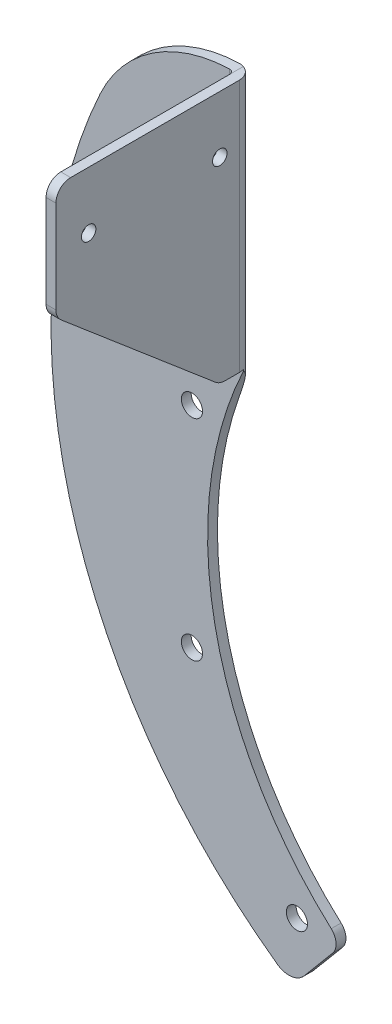
ISO-10303-21;
HEADER;
FILE_DESCRIPTION(('STEP AP214'),'2;1');
FILE_NAME('part.step','',(''),(''),'','','');
FILE_SCHEMA(('AUTOMOTIVE_DESIGN { 1 0 10303 214 1 1 1 1 }'));
ENDSEC;
DATA;
#1=APPLICATION_CONTEXT('core data for automotive mechanical design processes');
#2=APPLICATION_PROTOCOL_DEFINITION('international standard','automotive_design',2000,#1);
#3=PRODUCT_CONTEXT('',#1,'mechanical');
#4=PRODUCT('Part','Part','',(#3));
#5=PRODUCT_RELATED_PRODUCT_CATEGORY('part','',(#4));
#6=PRODUCT_DEFINITION_FORMATION('','',#4);
#7=PRODUCT_DEFINITION_CONTEXT('part definition',#1,'design');
#8=PRODUCT_DEFINITION('design','',#6,#7);
#9=PRODUCT_DEFINITION_SHAPE('','',#8);
#10=(LENGTH_UNIT() NAMED_UNIT(*) SI_UNIT(.MILLI.,.METRE.));
#11=(NAMED_UNIT(*) PLANE_ANGLE_UNIT() SI_UNIT($,.RADIAN.));
#12=(NAMED_UNIT(*) SI_UNIT($,.STERADIAN.) SOLID_ANGLE_UNIT());
#13=UNCERTAINTY_MEASURE_WITH_UNIT(LENGTH_MEASURE(1.E-05),#10,'distance_accuracy_value','');
#14=(GEOMETRIC_REPRESENTATION_CONTEXT(3) GLOBAL_UNCERTAINTY_ASSIGNED_CONTEXT((#13)) GLOBAL_UNIT_ASSIGNED_CONTEXT((#10,
#11,#12)) REPRESENTATION_CONTEXT('',''));
#15=CARTESIAN_POINT('',(0.,0.,0.));
#16=DIRECTION('',(0.,0.,1.));
#17=DIRECTION('',(1.,0.,0.));
#18=AXIS2_PLACEMENT_3D('',#15,#16,#17);
#19=CARTESIAN_POINT('',(-69.062,84.407732,2.));
#20=DIRECTION('',(0.,-1.,0.));
#21=DIRECTION('',(1.,0.,0.));
#22=AXIS2_PLACEMENT_3D('',#19,#20,#21);
#23=PLANE('',#22);
#24=DIRECTION('',(0.,0.,-1.));
#25=VECTOR('',#24,1.);
#26=CARTESIAN_POINT('',(-71.062,84.407732,40.3));
#27=LINE('',#26,#25);
#28=CARTESIAN_POINT('',(-71.062,84.407732,37.3));
#29=VERTEX_POINT('',#28);
#30=CARTESIAN_POINT('',(-71.062,84.407732,3.));
#31=VERTEX_POINT('',#30);
#32=EDGE_CURVE('E193',#29,#31,#27,.T.);
#33=ORIENTED_EDGE('',*,*,#32,.F.);
#34=DIRECTION('',(-1.,0.,0.));
#35=VECTOR('',#34,1.);
#36=CARTESIAN_POINT('',(-69.062,84.407732,37.3));
#37=LINE('',#36,#35);
#38=CARTESIAN_POINT('',(-69.062,84.407732,37.3));
#39=VERTEX_POINT('',#38);
#40=EDGE_CURVE('E283',#29,#39,#37,.F.);
#41=ORIENTED_EDGE('',*,*,#40,.T.);
#42=DIRECTION('',(0.,0.,-1.));
#43=VECTOR('',#42,1.);
#44=CARTESIAN_POINT('',(-69.062,84.407732,2.));
#45=LINE('',#44,#43);
#46=CARTESIAN_POINT('',(-69.062,84.407732,3.));
#47=VERTEX_POINT('',#46);
#48=EDGE_CURVE('E190',#39,#47,#45,.T.);
#49=ORIENTED_EDGE('',*,*,#48,.T.);
#50=CARTESIAN_POINT('',(-72.062,84.4077319999999,3.));
#51=DIRECTION('',(0.,-1.,0.));
#52=DIRECTION('',(1.,0.,0.));
#53=AXIS2_PLACEMENT_3D('',#50,#51,#52);
#54=CIRCLE('',#53,3.);
#55=CARTESIAN_POINT('',(-71.062,84.407732,0.17157287525381));
#56=VERTEX_POINT('',#55);
#57=EDGE_CURVE('E391',#47,#56,#54,.F.);
#58=ORIENTED_EDGE('',*,*,#57,.T.);
#59=DIRECTION('',(0.,0.,-1.));
#60=VECTOR('',#59,1.);
#61=CARTESIAN_POINT('',(-71.062,84.407732,2.));
#62=LINE('',#61,#60);
#63=EDGE_CURVE('E175',#31,#56,#62,.T.);
#64=ORIENTED_EDGE('',*,*,#63,.F.);
#65=EDGE_LOOP('',(#33,#41,#49,#58,#64));
#66=FACE_BOUND('',#65,.T.);
#67=ADVANCED_FACE('F35',(#66),#23,.F.);
#68=CARTESIAN_POINT('',(-71.062,54.407732,2.));
#69=DIRECTION('',(0.,0.,-1.));
#70=DIRECTION('',(-1.,0.,0.));
#71=AXIS2_PLACEMENT_3D('',#68,#69,#70);
#72=CYLINDRICAL_SURFACE('',#71,30.);
#73=ORIENTED_EDGE('',*,*,#63,.T.);
#74=CARTESIAN_POINT('',(-71.062,84.407732,0.17157287525381));
#75=CARTESIAN_POINT('',(-71.1424033557124,84.4077350978103,0.143136378054402));
#76=CARTESIAN_POINT('',(-71.2240237864179,84.4074087733322,0.118146058690424));
#77=CARTESIAN_POINT('',(-71.3884924579276,84.4060664678988,0.075356078348947));
#78=CARTESIAN_POINT('',(-71.4713275552939,84.4050554901699,0.0575057356979808));
#79=CARTESIAN_POINT('',(-71.63819947406,84.4023141011214,0.0288790762948991));
#80=CARTESIAN_POINT('',(-71.7222362954874,84.4005836897852,0.0181027597051738));
#81=CARTESIAN_POINT('',(-71.8915162290743,84.3963827801424,0.00363260161843973));
#82=CARTESIAN_POINT('',(-71.9767636691685,84.3939069838829,-9.08981232128017E-06));
#83=CARTESIAN_POINT('',(-72.062,84.3910607011299,0.));
#84=B_SPLINE_CURVE_WITH_KNOTS('',3,(#74,#75,#76,#77,#78,#79,#80,#81,#82,#83),.UNSPECIFIED.,.F.,
.F.,(4,2,2,2,4),(0.,0.255770967159507,0.509692727836477,0.763614494342432,1.01938546089779),.UNSPECIFIED.);
#85=CARTESIAN_POINT('',(-72.062,84.3910607011299,0.));
#86=VERTEX_POINT('',#85);
#87=EDGE_CURVE('E241',#56,#86,#84,.T.);
#88=ORIENTED_EDGE('',*,*,#87,.T.);
#89=CARTESIAN_POINT('',(-71.062,54.407732,0.));
#90=DIRECTION('',(0.,0.,1.));
#91=DIRECTION('',(1.,0.,0.));
#92=AXIS2_PLACEMENT_3D('',#89,#90,#91);
#93=CIRCLE('',#92,30.);
#94=CARTESIAN_POINT('',(-98.3280627445478,66.9201986796913,0.));
#95=VERTEX_POINT('',#94);
#96=EDGE_CURVE('E172',#86,#95,#93,.T.);
#97=ORIENTED_EDGE('',*,*,#96,.T.);
#98=DIRECTION('',(0.,0.,-1.));
#99=VECTOR('',#98,1.);
#100=CARTESIAN_POINT('',(-98.3280627445478,66.9201986796913,2.));
#101=LINE('',#100,#99);
#102=CARTESIAN_POINT('',(-98.3280627445478,66.9201986796913,2.));
#103=VERTEX_POINT('',#102);
#104=EDGE_CURVE('E168',#103,#95,#101,.T.);
#105=ORIENTED_EDGE('',*,*,#104,.F.);
#106=CARTESIAN_POINT('',(-71.062,54.407732,2.));
#107=DIRECTION('',(0.,0.,1.));
#108=DIRECTION('',(1.,0.,0.));
#109=AXIS2_PLACEMENT_3D('',#106,#107,#108);
#110=CIRCLE('',#109,30.);
#111=CARTESIAN_POINT('',(-72.062,84.3910607011299,2.));
#112=VERTEX_POINT('',#111);
#113=EDGE_CURVE('E153',#112,#103,#110,.T.);
#114=ORIENTED_EDGE('',*,*,#113,.F.);
#115=CARTESIAN_POINT('',(-72.062,84.3910607011299,2.));
#116=CARTESIAN_POINT('',(-72.0338823929811,84.3919986972093,2.00000018635966));
#117=CARTESIAN_POINT('',(-72.0057768724941,84.3928962009041,2.00118664759327));
#118=CARTESIAN_POINT('',(-71.9497640912681,84.3946067647525,2.0059205923625));
#119=CARTESIAN_POINT('',(-71.9218568217958,84.3954198286475,2.0094679712377));
#120=CARTESIAN_POINT('',(-71.8387807844865,84.397724766707,2.0236188463727));
#121=CARTESIAN_POINT('',(-71.7841643242773,84.3990854893442,2.0377311697776));
#122=CARTESIAN_POINT('',(-71.6780686254976,84.4014527590172,2.07492562444436));
#123=CARTESIAN_POINT('',(-71.6265909630799,84.4024591293061,2.09801221993162));
#124=CARTESIAN_POINT('',(-71.5282392978661,84.4041491254227,2.15249927833108));
#125=CARTESIAN_POINT('',(-71.4813644600485,84.4048328098767,2.18389822942267));
#126=CARTESIAN_POINT('',(-71.393564014164,84.405931892962,2.25410934958388));
#127=CARTESIAN_POINT('',(-71.352636619843,84.4063473722756,2.29291928470267));
#128=CARTESIAN_POINT('',(-71.2778663721899,84.4069787123102,2.37686769211449));
#129=CARTESIAN_POINT('',(-71.2440249218065,84.4071945335297,2.42200741469616));
#130=CARTESIAN_POINT('',(-71.1843896662936,84.4074972261746,2.51733707471053));
#131=CARTESIAN_POINT('',(-71.1585984602988,84.4075840559872,2.56752863629786));
#132=CARTESIAN_POINT('',(-71.1158200823253,84.4076913963138,2.67151904122236));
#133=CARTESIAN_POINT('',(-71.0988277773644,84.4077119455303,2.72531576069588));
#134=CARTESIAN_POINT('',(-71.0783395131147,84.407728648765,2.81619966118399));
#135=CARTESIAN_POINT('',(-71.0722159414758,84.4077307388446,2.85271616450744));
#136=CARTESIAN_POINT('',(-71.0640466936291,84.4077320089418,2.9261500162548));
#137=CARTESIAN_POINT('',(-71.0619952556141,84.4077311930756,2.96306672389108));
#138=CARTESIAN_POINT('',(-71.062,84.407732,3.00000000000001));
#139=B_SPLINE_CURVE_WITH_KNOTS('',3,(#115,#116,#117,#118,#119,#120,#121,#122,#123,#124,#125,
#126,#127,#128,#129,#130,#131,#132,#133,#134,#135,#136,#137,#138),.UNSPECIFIED.,.F.,.F.,(4,2,2,
2,2,2,2,2,2,2,2,4),(0.,0.0843480010913691,0.168692263251201,0.337103812119816,0.505599244250013,
0.674064052080476,0.842478158181814,1.01092557719145,1.179427325699,1.34783066491211,
1.45869829478178,1.56940894194911),.UNSPECIFIED.);
#140=EDGE_CURVE('E214',#112,#31,#139,.T.);
#141=ORIENTED_EDGE('',*,*,#140,.T.);
#142=EDGE_LOOP('',(#73,#88,#97,#105,#114,#141));
#143=FACE_BOUND('',#142,.T.);
#144=ADVANCED_FACE('F170',(#143),#72,.T.);
#145=CARTESIAN_POINT('',(1.64750065212732,21.0411541874898,2.));
#146=DIRECTION('',(0.,0.,-1.));
#147=DIRECTION('',(-1.,0.,0.));
#148=AXIS2_PLACEMENT_3D('',#145,#146,#147);
#149=CYLINDRICAL_SURFACE('',#148,110.);
#150=CARTESIAN_POINT('',(1.64750065212732,21.0411541874898,0.));
#151=DIRECTION('',(0.,0.,1.));
#152=DIRECTION('',(1.,0.,0.));
#153=AXIS2_PLACEMENT_3D('',#150,#151,#152);
#154=CIRCLE('',#153,110.);
#155=CARTESIAN_POINT('',(-62.2753484705595,-68.4790634174637,0.));
#156=VERTEX_POINT('',#155);
#157=EDGE_CURVE('E192',#95,#156,#154,.T.);
#158=ORIENTED_EDGE('',*,*,#157,.T.);
#159=DIRECTION('',(0.,0.,-1.));
#160=VECTOR('',#159,1.);
#161=CARTESIAN_POINT('',(-62.2753484705595,-68.4790634174637,2.));
#162=LINE('',#161,#160);
#163=CARTESIAN_POINT('',(-62.2753484705595,-68.4790634174637,2.));
#164=VERTEX_POINT('',#163);
#165=EDGE_CURVE('E176',#164,#156,#162,.T.);
#166=ORIENTED_EDGE('',*,*,#165,.F.);
#167=CARTESIAN_POINT('',(1.64750065212732,21.0411541874898,2.));
#168=DIRECTION('',(0.,0.,1.));
#169=DIRECTION('',(1.,0.,0.));
#170=AXIS2_PLACEMENT_3D('',#167,#168,#169);
#171=CIRCLE('',#170,110.);
#172=EDGE_CURVE('E158',#103,#164,#171,.T.);
#173=ORIENTED_EDGE('',*,*,#172,.F.);
#174=ORIENTED_EDGE('',*,*,#104,.T.);
#175=EDGE_LOOP('',(#158,#166,#173,#174));
#176=FACE_BOUND('',#175,.T.);
#177=ADVANCED_FACE('F178',(#176),#149,.T.);
#178=CARTESIAN_POINT('',(-59.9508812297345,-65.2237827772836,2.));
#179=DIRECTION('',(0.,0.,-1.));
#180=DIRECTION('',(-1.,0.,0.));
#181=AXIS2_PLACEMENT_3D('',#178,#179,#180);
#182=CYLINDRICAL_SURFACE('',#181,4.00000000000001);
#183=CARTESIAN_POINT('',(-59.9508812297345,-65.2237827772836,0.));
#184=DIRECTION('',(0.,0.,1.));
#185=DIRECTION('',(-1.,0.,0.));
#186=AXIS2_PLACEMENT_3D('',#183,#184,#185);
#187=CIRCLE('',#186,4.00000000000001);
#188=CARTESIAN_POINT('',(-56.8867034572586,-67.7949332160297,0.));
#189=VERTEX_POINT('',#188);
#190=EDGE_CURVE('E195',#156,#189,#187,.T.);
#191=ORIENTED_EDGE('',*,*,#190,.T.);
#192=DIRECTION('',(0.,0.,-1.));
#193=VECTOR('',#192,1.);
#194=CARTESIAN_POINT('',(-56.8867034572586,-67.7949332160297,2.));
#195=LINE('',#194,#193);
#196=CARTESIAN_POINT('',(-56.8867034572586,-67.7949332160297,2.));
#197=VERTEX_POINT('',#196);
#198=EDGE_CURVE('E202',#197,#189,#195,.T.);
#199=ORIENTED_EDGE('',*,*,#198,.F.);
#200=CARTESIAN_POINT('',(-59.9508812297345,-65.2237827772836,2.));
#201=DIRECTION('',(0.,0.,1.));
#202=DIRECTION('',(-1.,0.,0.));
#203=AXIS2_PLACEMENT_3D('',#200,#201,#202);
#204=CIRCLE('',#203,4.00000000000001);
#205=EDGE_CURVE('E181',#164,#197,#204,.T.);
#206=ORIENTED_EDGE('',*,*,#205,.F.);
#207=ORIENTED_EDGE('',*,*,#165,.T.);
#208=EDGE_LOOP('',(#191,#199,#206,#207));
#209=FACE_BOUND('',#208,.T.);
#210=ADVANCED_FACE('F268',(#209),#182,.T.);
#211=CARTESIAN_POINT('',(-49.1732521410201,-58.6023998986019,2.));
#212=DIRECTION('',(-0.76604444311898,0.642787609686537,0.));
#213=DIRECTION('',(-0.642787609686537,-0.76604444311898,0.));
#214=AXIS2_PLACEMENT_3D('',#211,#212,#213);
#215=PLANE('',#214);
#216=DIRECTION('',(0.642787609686537,0.76604444311898,0.));
#217=VECTOR('',#216,1.);
#218=CARTESIAN_POINT('',(-49.1732521410201,-58.6023998986019,0.));
#219=LINE('',#218,#217);
#220=CARTESIAN_POINT('',(-51.0652178038024,-60.8571567742876,0.));
#221=VERTEX_POINT('',#220);
#222=EDGE_CURVE('E197',#189,#221,#219,.T.);
#223=ORIENTED_EDGE('',*,*,#222,.T.);
#224=DIRECTION('',(0.,0.,-1.));
#225=VECTOR('',#224,1.);
#226=CARTESIAN_POINT('',(-51.0652178038024,-60.8571567742876,2.));
#227=LINE('',#226,#225);
#228=CARTESIAN_POINT('',(-51.0652178038024,-60.8571567742876,2.));
#229=VERTEX_POINT('',#228);
#230=EDGE_CURVE('E302',#221,#229,#227,.F.);
#231=ORIENTED_EDGE('',*,*,#230,.T.);
#232=DIRECTION('',(0.642787609686537,0.76604444311898,0.));
#233=VECTOR('',#232,1.);
#234=CARTESIAN_POINT('',(-49.1732521410201,-58.6023998986019,2.));
#235=LINE('',#234,#233);
#236=EDGE_CURVE('E183',#197,#229,#235,.T.);
#237=ORIENTED_EDGE('',*,*,#236,.F.);
#238=ORIENTED_EDGE('',*,*,#198,.T.);
#239=EDGE_LOOP('',(#223,#231,#237,#238));
#240=FACE_BOUND('',#239,.T.);
#241=ADVANCED_FACE('F263',(#240),#215,.F.);
#242=CARTESIAN_POINT('',(0.,0.,2.));
#243=DIRECTION('',(0.,0.,-1.));
#244=DIRECTION('',(-1.,0.,0.));
#245=AXIS2_PLACEMENT_3D('',#242,#243,#244);
#246=CYLINDRICAL_SURFACE('',#245,76.5);
#247=CARTESIAN_POINT('',(0.,0.,2.));
#248=DIRECTION('',(0.,0.,-1.));
#249=DIRECTION('',(1.,0.,0.));
#250=AXIS2_PLACEMENT_3D('',#247,#248,#249);
#251=CIRCLE('',#250,76.5);
#252=CARTESIAN_POINT('',(-51.3496397696439,-56.7050658718232,2.));
#253=VERTEX_POINT('',#252);
#254=CARTESIAN_POINT('',(-69.2335728752538,32.5417022745726,2.));
#255=VERTEX_POINT('',#254);
#256=EDGE_CURVE('E188',#253,#255,#251,.T.);
#257=ORIENTED_EDGE('',*,*,#256,.F.);
#258=DIRECTION('',(0.,0.,-1.));
#259=VECTOR('',#258,1.);
#260=CARTESIAN_POINT('',(-51.3496397696439,-56.7050658718232,2.));
#261=LINE('',#260,#259);
#262=CARTESIAN_POINT('',(-51.3496397696439,-56.7050658718232,0.));
#263=VERTEX_POINT('',#262);
#264=EDGE_CURVE('E293',#253,#263,#261,.T.);
#265=ORIENTED_EDGE('',*,*,#264,.T.);
#266=CARTESIAN_POINT('',(0.,0.,0.));
#267=DIRECTION('',(0.,0.,-1.));
#268=DIRECTION('',(1.,0.,0.));
#269=AXIS2_PLACEMENT_3D('',#266,#267,#268);
#270=CIRCLE('',#269,76.5);
#271=CARTESIAN_POINT('',(-72.062,25.6771913573117,0.));
#272=VERTEX_POINT('',#271);
#273=EDGE_CURVE('E165',#263,#272,#270,.T.);
#274=ORIENTED_EDGE('',*,*,#273,.T.);
#275=CARTESIAN_POINT('',(-72.062,25.6771913573117,0.));
#276=CARTESIAN_POINT('',(-71.9974517357098,25.8583453525249,1.04025568251124E-05));
#277=CARTESIAN_POINT('',(-71.9322164551901,26.0392632082621,0.00208404209849964));
#278=CARTESIAN_POINT('',(-71.8004081454495,26.4005368047451,0.0106941228102082));
#279=CARTESIAN_POINT('',(-71.7338348978226,26.5808924480746,0.0172312984333695));
#280=CARTESIAN_POINT('',(-71.5991269258244,26.9416453799293,0.0351423976599732));
#281=CARTESIAN_POINT('',(-71.5309868326175,27.1220396839003,0.0465364487231194));
#282=CARTESIAN_POINT('',(-71.3934857588402,27.4819449184529,0.0745917210635172));
#283=CARTESIAN_POINT('',(-71.3241248388204,27.6614558922839,0.091252681804066));
#284=CARTESIAN_POINT('',(-71.1804613932142,28.0291448562404,0.13141966286683));
#285=CARTESIAN_POINT('',(-71.1060952890811,28.2172631742717,0.155248711672079));
#286=CARTESIAN_POINT('',(-70.9562418650828,28.5919998230385,0.210077712139193));
#287=CARTESIAN_POINT('',(-70.8807546164062,28.7786182478619,0.241077210310393));
#288=CARTESIAN_POINT('',(-70.7289717787754,29.1496597378457,0.311131654591096));
#289=CARTESIAN_POINT('',(-70.6526776771147,29.3340858389062,0.350173627176788));
#290=CARTESIAN_POINT('',(-70.4994577705089,29.7004350670219,0.437531189219662));
#291=CARTESIAN_POINT('',(-70.422532149791,29.8823588853191,0.48584416014262));
#292=CARTESIAN_POINT('',(-70.289922943076,30.1926604856669,0.578362847716177));
#293=CARTESIAN_POINT('',(-70.2342916689906,30.3218366706127,0.619963383885431));
#294=CARTESIAN_POINT('',(-70.1231427989986,30.5780039660291,0.709599366607305));
#295=CARTESIAN_POINT('',(-70.067625200271,30.7049951313171,0.757634651460084));
#296=CARTESIAN_POINT('',(-69.9578067825369,30.9543788661535,0.860386195681818));
#297=CARTESIAN_POINT('',(-69.9034998233156,31.0768109662418,0.914999193483619));
#298=CARTESIAN_POINT('',(-69.7957488427917,31.3180599937714,1.03264647328964));
#299=CARTESIAN_POINT('',(-69.7423050759405,31.4368758640319,1.09568318942342));
#300=CARTESIAN_POINT('',(-69.6481299183363,31.6448754920678,1.21735382066401));
#301=CARTESIAN_POINT('',(-69.6070976712453,31.7350174786391,1.27410556829687));
#302=CARTESIAN_POINT('',(-69.5265997724604,31.9109897463142,1.39469639044105));
#303=CARTESIAN_POINT('',(-69.4871319497091,31.9968260500394,1.45852514029741));
#304=CARTESIAN_POINT('',(-69.4097878730353,32.1642654728963,1.59569232326101));
#305=CARTESIAN_POINT('',(-69.3719503948391,32.2457710585946,1.66917475539028));
#306=CARTESIAN_POINT('',(-69.3178081357986,32.3619115982417,1.78703378456106));
#307=CARTESIAN_POINT('',(-69.3001567370947,32.3996896663022,1.82770075189597));
#308=CARTESIAN_POINT('',(-69.2659673280037,32.4727178858384,1.91176500030436));
#309=CARTESIAN_POINT('',(-69.249430565866,32.5079652059907,1.95516524047536));
#310=CARTESIAN_POINT('',(-69.2335728752538,32.5417022745726,2.));
#311=B_SPLINE_CURVE_WITH_KNOTS('',3,(#275,#276,#277,#278,#279,#280,#281,#282,#283,#284,#285,
#286,#287,#288,#289,#290,#291,#292,#293,#294,#295,#296,#297,#298,#299,#300,#301,#302,#303,#304,
#305,#306,#307,#308,#309,#310),.UNSPECIFIED.,.F.,.F.,(4,2,2,2,2,2,2,2,2,2,2,2,2,2,2,2,2,4),(0.,
0.576930597176576,1.15395614835815,1.73339657113636,2.31280833538621,2.92373584222635,
3.5346247218908,4.14453577119324,4.75427480789766,5.19415371908441,5.63402157855558,
6.06771413739312,6.50153228873418,6.8437229988847,7.18542089665554,7.53296404867859,
7.70758536202697,7.88239908676451),.UNSPECIFIED.);
#312=EDGE_CURVE('E247',#272,#255,#311,.T.);
#313=ORIENTED_EDGE('',*,*,#312,.T.);
#314=EDGE_LOOP('',(#257,#265,#274,#313));
#315=FACE_BOUND('',#314,.T.);
#316=ADVANCED_FACE('F257',(#315),#246,.F.);
#317=CARTESIAN_POINT('',(-69.062,84.407732,2.));
#318=DIRECTION('',(-1.,0.,0.));
#319=DIRECTION('',(0.,-1.,0.));
#320=AXIS2_PLACEMENT_3D('',#317,#318,#319);
#321=PLANE('',#320);
#322=CARTESIAN_POINT('',(-69.062,72.803866,33.6333333333333));
#323=DIRECTION('',(1.,0.,0.));
#324=DIRECTION('',(0.,0.,-1.));
#325=AXIS2_PLACEMENT_3D('',#322,#323,#324);
#326=CIRCLE('',#325,1.47319999999999);
#327=CARTESIAN_POINT('',(-69.062,72.803866,32.1601333333333));
#328=VERTEX_POINT('',#327);
#329=EDGE_CURVE('E327',#328,#328,#326,.T.);
#330=ORIENTED_EDGE('',*,*,#329,.F.);
#331=EDGE_LOOP('',(#330));
#332=FACE_BOUND('',#331,.T.);
#333=CARTESIAN_POINT('',(-69.062,72.803866,6.96666666666667));
#334=DIRECTION('',(1.,0.,0.));
#335=DIRECTION('',(0.,0.,-1.));
#336=AXIS2_PLACEMENT_3D('',#333,#334,#335);
#337=CIRCLE('',#336,1.47319999999999);
#338=CARTESIAN_POINT('',(-69.062,72.803866,5.49346666666667));
#339=VERTEX_POINT('',#338);
#340=EDGE_CURVE('E370',#339,#339,#337,.T.);
#341=ORIENTED_EDGE('',*,*,#340,.F.);
#342=EDGE_LOOP('',(#341));
#343=FACE_BOUND('',#342,.T.);
#344=DIRECTION('',(0.,0.647525422676108,0.762043848468136));
#345=VECTOR('',#344,1.);
#346=CARTESIAN_POINT('',(-69.062,61.2,40.3));
#347=LINE('',#346,#345);
#348=CARTESIAN_POINT('',(-69.062,33.6181258691005,7.84012000979325));
#349=VERTEX_POINT('',#348);
#350=CARTESIAN_POINT('',(-69.062,60.3014837920822,39.2425762680283));
#351=VERTEX_POINT('',#350);
#352=EDGE_CURVE('E328',#349,#351,#347,.T.);
#353=ORIENTED_EDGE('',*,*,#352,.F.);
#354=CARTESIAN_POINT('',(-69.062,35.9042574145049,5.89754374176492));
#355=DIRECTION('',(-1.,0.,0.));
#356=DIRECTION('',(0.,-1.,0.));
#357=AXIS2_PLACEMENT_3D('',#354,#355,#356);
#358=CIRCLE('',#357,3.);
#359=CARTESIAN_POINT('',(-69.062,32.9042574145049,5.89754374176493));
#360=VERTEX_POINT('',#359);
#361=EDGE_CURVE('E313',#349,#360,#358,.F.);
#362=ORIENTED_EDGE('',*,*,#361,.T.);
#363=DIRECTION('',(0.,0.,-1.));
#364=VECTOR('',#363,1.);
#365=CARTESIAN_POINT('',(-69.062,32.9042574145049,40.3));
#366=LINE('',#365,#364);
#367=CARTESIAN_POINT('',(-69.062,32.9042574145049,3.));
#368=VERTEX_POINT('',#367);
#369=EDGE_CURVE('E333',#360,#368,#366,.T.);
#370=ORIENTED_EDGE('',*,*,#369,.T.);
#371=DIRECTION('',(0.,1.,0.));
#372=VECTOR('',#371,1.);
#373=CARTESIAN_POINT('',(-69.062,84.407732,3.));
#374=LINE('',#373,#372);
#375=EDGE_CURVE('E221',#368,#47,#374,.T.);
#376=ORIENTED_EDGE('',*,*,#375,.T.);
#377=ORIENTED_EDGE('',*,*,#48,.F.);
#378=CARTESIAN_POINT('',(-69.062,81.407732,37.3));
#379=DIRECTION('',(-1.,0.,0.));
#380=DIRECTION('',(0.,-1.,0.));
#381=AXIS2_PLACEMENT_3D('',#378,#379,#380);
#382=CIRCLE('',#381,3.);
#383=CARTESIAN_POINT('',(-69.062,81.407732,40.3));
#384=VERTEX_POINT('',#383);
#385=EDGE_CURVE('E292',#39,#384,#382,.F.);
#386=ORIENTED_EDGE('',*,*,#385,.T.);
#387=DIRECTION('',(0.,1.,0.));
#388=VECTOR('',#387,1.);
#389=CARTESIAN_POINT('',(-69.062,84.407732,40.3));
#390=LINE('',#389,#388);
#391=CARTESIAN_POINT('',(-69.062,62.5876153374866,40.3));
#392=VERTEX_POINT('',#391);
#393=EDGE_CURVE('E343',#392,#384,#390,.T.);
#394=ORIENTED_EDGE('',*,*,#393,.F.);
#395=CARTESIAN_POINT('',(-69.062,62.5876153374866,37.3));
#396=DIRECTION('',(-1.,0.,0.));
#397=DIRECTION('',(0.,-1.,0.));
#398=AXIS2_PLACEMENT_3D('',#395,#396,#397);
#399=CIRCLE('',#398,3.);
#400=EDGE_CURVE('E311',#392,#351,#399,.F.);
#401=ORIENTED_EDGE('',*,*,#400,.T.);
#402=EDGE_LOOP('',(#353,#362,#370,#376,#377,#386,#394,#401));
#403=FACE_BOUND('',#402,.T.);
#404=ADVANCED_FACE('F262',(#332,#343,#403),#321,.F.);
#405=CARTESIAN_POINT('',(-71.062,54.407732,2.));
#406=DIRECTION('',(0.,0.,1.));
#407=DIRECTION('',(1.,0.,0.));
#408=AXIS2_PLACEMENT_3D('',#405,#406,#407);
#409=PLANE('',#408);
#410=CARTESIAN_POINT('',(-79.6888806688481,21.352571220958,2.));
#411=DIRECTION('',(0.,0.,1.));
#412=DIRECTION('',(1.,0.,0.));
#413=AXIS2_PLACEMENT_3D('',#410,#411,#412);
#414=CIRCLE('',#413,2.15264999999999);
#415=CARTESIAN_POINT('',(-77.5362306688481,21.352571220958,2.));
#416=VERTEX_POINT('',#415);
#417=EDGE_CURVE('E364',#416,#416,#414,.T.);
#418=ORIENTED_EDGE('',*,*,#417,.F.);
#419=EDGE_LOOP('',(#418));
#420=FACE_BOUND('',#419,.T.);
#421=CARTESIAN_POINT('',(-79.6888806688481,-21.352571220958,2.));
#422=DIRECTION('',(0.,0.,1.));
#423=DIRECTION('',(1.,0.,0.));
#424=AXIS2_PLACEMENT_3D('',#421,#422,#423);
#425=CIRCLE('',#424,2.15264999999999);
#426=CARTESIAN_POINT('',(-77.5362306688481,-21.352571220958,2.));
#427=VERTEX_POINT('',#426);
#428=EDGE_CURVE('E358',#427,#427,#425,.T.);
#429=ORIENTED_EDGE('',*,*,#428,.F.);
#430=EDGE_LOOP('',(#429));
#431=FACE_BOUND('',#430,.T.);
#432=CARTESIAN_POINT('',(-58.33630944789,-58.3363094478903,2.));
#433=DIRECTION('',(0.,0.,1.));
#434=DIRECTION('',(1.,0.,0.));
#435=AXIS2_PLACEMENT_3D('',#432,#433,#434);
#436=CIRCLE('',#435,2.15264999999999);
#437=CARTESIAN_POINT('',(-56.18365944789,-58.3363094478903,2.));
#438=VERTEX_POINT('',#437);
#439=EDGE_CURVE('E352',#438,#438,#436,.T.);
#440=ORIENTED_EDGE('',*,*,#439,.F.);
#441=EDGE_LOOP('',(#440));
#442=FACE_BOUND('',#441,.T.);
#443=ORIENTED_EDGE('',*,*,#236,.T.);
#444=CARTESIAN_POINT('',(-53.3633511331593,-58.928793945228,2.));
#445=DIRECTION('',(0.,0.,1.));
#446=DIRECTION('',(1.,0.,0.));
#447=AXIS2_PLACEMENT_3D('',#444,#445,#446);
#448=CIRCLE('',#447,3.);
#449=EDGE_CURVE('E304',#229,#253,#448,.T.);
#450=ORIENTED_EDGE('',*,*,#449,.T.);
#451=ORIENTED_EDGE('',*,*,#256,.T.);
#452=DIRECTION('',(0.,1.,0.));
#453=VECTOR('',#452,1.);
#454=CARTESIAN_POINT('',(-69.2335728752538,32.5417022745726,2.));
#455=LINE('',#454,#453);
#456=CARTESIAN_POINT('',(-69.2335728752538,32.9042574145049,2.));
#457=VERTEX_POINT('',#456);
#458=EDGE_CURVE('E254',#255,#457,#455,.T.);
#459=ORIENTED_EDGE('',*,*,#458,.T.);
#460=DIRECTION('',(1.,0.,0.));
#461=VECTOR('',#460,1.);
#462=CARTESIAN_POINT('',(-69.062,32.9042574145049,2.));
#463=LINE('',#462,#461);
#464=CARTESIAN_POINT('',(-72.062,32.9042574145049,2.));
#465=VERTEX_POINT('',#464);
#466=EDGE_CURVE('E346',#465,#457,#463,.T.);
#467=ORIENTED_EDGE('',*,*,#466,.F.);
#468=DIRECTION('',(0.,-1.,0.));
#469=VECTOR('',#468,1.);
#470=CARTESIAN_POINT('',(-72.062,54.407732,2.));
#471=LINE('',#470,#469);
#472=EDGE_CURVE('E161',#465,#112,#471,.F.);
#473=ORIENTED_EDGE('',*,*,#472,.T.);
#474=ORIENTED_EDGE('',*,*,#113,.T.);
#475=ORIENTED_EDGE('',*,*,#172,.T.);
#476=ORIENTED_EDGE('',*,*,#205,.T.);
#477=EDGE_LOOP('',(#443,#450,#451,#459,#467,#473,#474,#475,#476));
#478=FACE_BOUND('',#477,.T.);
#479=ADVANCED_FACE('F156',(#420,#431,#442,#478),#409,.T.);
#480=CARTESIAN_POINT('',(-71.062,54.407732,0.));
#481=DIRECTION('',(0.,0.,1.));
#482=DIRECTION('',(1.,0.,0.));
#483=AXIS2_PLACEMENT_3D('',#480,#481,#482);
#484=PLANE('',#483);
#485=CARTESIAN_POINT('',(-79.6888806688481,21.352571220958,0.));
#486=DIRECTION('',(0.,0.,1.));
#487=DIRECTION('',(1.,0.,0.));
#488=AXIS2_PLACEMENT_3D('',#485,#486,#487);
#489=CIRCLE('',#488,2.15264999999999);
#490=CARTESIAN_POINT('',(-77.5362306688481,21.352571220958,0.));
#491=VERTEX_POINT('',#490);
#492=EDGE_CURVE('E361',#491,#491,#489,.T.);
#493=ORIENTED_EDGE('',*,*,#492,.T.);
#494=EDGE_LOOP('',(#493));
#495=FACE_BOUND('',#494,.T.);
#496=CARTESIAN_POINT('',(-79.6888806688481,-21.352571220958,0.));
#497=DIRECTION('',(0.,0.,1.));
#498=DIRECTION('',(1.,0.,0.));
#499=AXIS2_PLACEMENT_3D('',#496,#497,#498);
#500=CIRCLE('',#499,2.15264999999999);
#501=CARTESIAN_POINT('',(-77.5362306688481,-21.352571220958,0.));
#502=VERTEX_POINT('',#501);
#503=EDGE_CURVE('E355',#502,#502,#500,.T.);
#504=ORIENTED_EDGE('',*,*,#503,.T.);
#505=EDGE_LOOP('',(#504));
#506=FACE_BOUND('',#505,.T.);
#507=CARTESIAN_POINT('',(-58.33630944789,-58.3363094478903,0.));
#508=DIRECTION('',(0.,0.,1.));
#509=DIRECTION('',(1.,0.,0.));
#510=AXIS2_PLACEMENT_3D('',#507,#508,#509);
#511=CIRCLE('',#510,2.15265);
#512=CARTESIAN_POINT('',(-56.18365944789,-58.3363094478903,0.));
#513=VERTEX_POINT('',#512);
#514=EDGE_CURVE('E347',#513,#513,#511,.T.);
#515=ORIENTED_EDGE('',*,*,#514,.T.);
#516=EDGE_LOOP('',(#515));
#517=FACE_BOUND('',#516,.T.);
#518=ORIENTED_EDGE('',*,*,#273,.F.);
#519=CARTESIAN_POINT('',(-53.3633511331593,-58.928793945228,0.));
#520=DIRECTION('',(0.,0.,1.));
#521=DIRECTION('',(1.,0.,0.));
#522=AXIS2_PLACEMENT_3D('',#519,#520,#521);
#523=CIRCLE('',#522,3.);
#524=EDGE_CURVE('E296',#263,#221,#523,.F.);
#525=ORIENTED_EDGE('',*,*,#524,.T.);
#526=ORIENTED_EDGE('',*,*,#222,.F.);
#527=ORIENTED_EDGE('',*,*,#190,.F.);
#528=ORIENTED_EDGE('',*,*,#157,.F.);
#529=ORIENTED_EDGE('',*,*,#96,.F.);
#530=DIRECTION('',(0.,1.,0.));
#531=VECTOR('',#530,1.);
#532=CARTESIAN_POINT('',(-72.062,54.407732,0.));
#533=LINE('',#532,#531);
#534=EDGE_CURVE('E255',#86,#272,#533,.F.);
#535=ORIENTED_EDGE('',*,*,#534,.T.);
#536=EDGE_LOOP('',(#518,#525,#526,#527,#528,#529,#535));
#537=FACE_BOUND('',#536,.T.);
#538=ADVANCED_FACE('F396',(#495,#506,#517,#537),#484,.F.);
#539=CARTESIAN_POINT('',(-71.062,84.407732,40.3));
#540=DIRECTION('',(1.,0.,0.));
#541=DIRECTION('',(0.,0.,-1.));
#542=AXIS2_PLACEMENT_3D('',#539,#540,#541);
#543=PLANE('',#542);
#544=CARTESIAN_POINT('',(-71.062,72.803866,33.6333333333333));
#545=DIRECTION('',(1.,0.,0.));
#546=DIRECTION('',(0.,0.,-1.));
#547=AXIS2_PLACEMENT_3D('',#544,#545,#546);
#548=CIRCLE('',#547,1.47319999999999);
#549=CARTESIAN_POINT('',(-71.062,72.803866,32.1601333333333));
#550=VERTEX_POINT('',#549);
#551=EDGE_CURVE('E373',#550,#550,#548,.T.);
#552=ORIENTED_EDGE('',*,*,#551,.T.);
#553=EDGE_LOOP('',(#552));
#554=FACE_BOUND('',#553,.T.);
#555=CARTESIAN_POINT('',(-71.062,72.803866,6.96666666666667));
#556=DIRECTION('',(1.,0.,0.));
#557=DIRECTION('',(0.,0.,-1.));
#558=AXIS2_PLACEMENT_3D('',#555,#556,#557);
#559=CIRCLE('',#558,1.47319999999999);
#560=CARTESIAN_POINT('',(-71.062,72.803866,5.49346666666667));
#561=VERTEX_POINT('',#560);
#562=EDGE_CURVE('E367',#561,#561,#559,.T.);
#563=ORIENTED_EDGE('',*,*,#562,.T.);
#564=EDGE_LOOP('',(#563));
#565=FACE_BOUND('',#564,.T.);
#566=DIRECTION('',(0.,0.,-1.));
#567=VECTOR('',#566,1.);
#568=CARTESIAN_POINT('',(-71.062,32.9042574145049,40.3));
#569=LINE('',#568,#567);
#570=CARTESIAN_POINT('',(-71.062,32.9042574145049,5.89754374176493));
#571=VERTEX_POINT('',#570);
#572=CARTESIAN_POINT('',(-71.062,32.9042574145049,3.));
#573=VERTEX_POINT('',#572);
#574=EDGE_CURVE('E285',#571,#573,#569,.T.);
#575=ORIENTED_EDGE('',*,*,#574,.F.);
#576=CARTESIAN_POINT('',(-71.062,35.9042574145049,5.89754374176492));
#577=DIRECTION('',(1.,0.,0.));
#578=DIRECTION('',(0.,0.,-1.));
#579=AXIS2_PLACEMENT_3D('',#576,#577,#578);
#580=CIRCLE('',#579,3.);
#581=CARTESIAN_POINT('',(-71.062,33.6181258691005,7.84012000979324));
#582=VERTEX_POINT('',#581);
#583=EDGE_CURVE('E43',#571,#582,#580,.F.);
#584=ORIENTED_EDGE('',*,*,#583,.T.);
#585=DIRECTION('',(0.,0.647525422676108,0.762043848468136));
#586=VECTOR('',#585,1.);
#587=CARTESIAN_POINT('',(-71.062,70.9307507577612,51.7516874492473));
#588=LINE('',#587,#586);
#589=CARTESIAN_POINT('',(-71.062,60.3014837920822,39.2425762680283));
#590=VERTEX_POINT('',#589);
#591=EDGE_CURVE('E319',#582,#590,#588,.T.);
#592=ORIENTED_EDGE('',*,*,#591,.T.);
#593=CARTESIAN_POINT('',(-71.062,62.5876153374866,37.3));
#594=DIRECTION('',(1.,0.,0.));
#595=DIRECTION('',(0.,0.,-1.));
#596=AXIS2_PLACEMENT_3D('',#593,#594,#595);
#597=CIRCLE('',#596,3.);
#598=CARTESIAN_POINT('',(-71.062,62.5876153374866,40.3));
#599=VERTEX_POINT('',#598);
#600=EDGE_CURVE('E50',#590,#599,#597,.F.);
#601=ORIENTED_EDGE('',*,*,#600,.T.);
#602=DIRECTION('',(0.,-1.,0.));
#603=VECTOR('',#602,1.);
#604=CARTESIAN_POINT('',(-71.062,84.407732,40.3));
#605=LINE('',#604,#603);
#606=CARTESIAN_POINT('',(-71.062,81.4077319999999,40.3));
#607=VERTEX_POINT('',#606);
#608=EDGE_CURVE('E340',#607,#599,#605,.T.);
#609=ORIENTED_EDGE('',*,*,#608,.F.);
#610=CARTESIAN_POINT('',(-71.062,81.4077319999999,37.3));
#611=DIRECTION('',(1.,0.,0.));
#612=DIRECTION('',(0.,0.,-1.));
#613=AXIS2_PLACEMENT_3D('',#610,#611,#612);
#614=CIRCLE('',#613,3.);
#615=EDGE_CURVE('E289',#607,#29,#614,.F.);
#616=ORIENTED_EDGE('',*,*,#615,.T.);
#617=ORIENTED_EDGE('',*,*,#32,.T.);
#618=DIRECTION('',(0.,-1.,0.));
#619=VECTOR('',#618,1.);
#620=CARTESIAN_POINT('',(-71.062,84.407732,3.));
#621=LINE('',#620,#619);
#622=EDGE_CURVE('E207',#31,#573,#621,.T.);
#623=ORIENTED_EDGE('',*,*,#622,.T.);
#624=EDGE_LOOP('',(#575,#584,#592,#601,#609,#616,#617,#623));
#625=FACE_BOUND('',#624,.T.);
#626=ADVANCED_FACE('F318',(#554,#565,#625),#543,.F.);
#627=CARTESIAN_POINT('',(-69.062,32.9042574145049,40.3));
#628=DIRECTION('',(0.,1.,0.));
#629=DIRECTION('',(0.,0.,1.));
#630=AXIS2_PLACEMENT_3D('',#627,#628,#629);
#631=PLANE('',#630);
#632=ORIENTED_EDGE('',*,*,#369,.F.);
#633=DIRECTION('',(1.,0.,0.));
#634=VECTOR('',#633,1.);
#635=CARTESIAN_POINT('',(-69.062,32.9042574145049,5.89754374176493));
#636=LINE('',#635,#634);
#637=EDGE_CURVE('E58',#360,#571,#636,.F.);
#638=ORIENTED_EDGE('',*,*,#637,.T.);
#639=ORIENTED_EDGE('',*,*,#574,.T.);
#640=CARTESIAN_POINT('',(-72.062,32.9042574145049,3.));
#641=DIRECTION('',(0.,1.,0.));
#642=DIRECTION('',(0.,0.,1.));
#643=AXIS2_PLACEMENT_3D('',#640,#641,#642);
#644=CIRCLE('',#643,1.);
#645=EDGE_CURVE('E211',#573,#465,#644,.T.);
#646=ORIENTED_EDGE('',*,*,#645,.T.);
#647=ORIENTED_EDGE('',*,*,#466,.T.);
#648=CARTESIAN_POINT('',(-72.062,32.9042574145049,3.));
#649=DIRECTION('',(0.,1.,0.));
#650=DIRECTION('',(0.,0.,1.));
#651=AXIS2_PLACEMENT_3D('',#648,#649,#650);
#652=CIRCLE('',#651,3.);
#653=EDGE_CURVE('E338',#457,#368,#652,.F.);
#654=ORIENTED_EDGE('',*,*,#653,.T.);
#655=EDGE_LOOP('',(#632,#638,#639,#646,#647,#654));
#656=FACE_BOUND('',#655,.T.);
#657=ADVANCED_FACE('F335',(#656),#631,.F.);
#658=CARTESIAN_POINT('',(0.,0.,40.3));
#659=DIRECTION('',(0.,0.,-1.));
#660=DIRECTION('',(-1.,0.,0.));
#661=AXIS2_PLACEMENT_3D('',#658,#659,#660);
#662=PLANE('',#661);
#663=ORIENTED_EDGE('',*,*,#608,.T.);
#664=DIRECTION('',(1.,0.,0.));
#665=VECTOR('',#664,1.);
#666=CARTESIAN_POINT('',(0.,62.5876153374866,40.3));
#667=LINE('',#666,#665);
#668=EDGE_CURVE('E11',#599,#392,#667,.T.);
#669=ORIENTED_EDGE('',*,*,#668,.T.);
#670=ORIENTED_EDGE('',*,*,#393,.T.);
#671=DIRECTION('',(-1.,0.,0.));
#672=VECTOR('',#671,1.);
#673=CARTESIAN_POINT('',(-2.2595184612229E-12,81.4077320000019,40.3));
#674=LINE('',#673,#672);
#675=EDGE_CURVE('E383',#384,#607,#674,.T.);
#676=ORIENTED_EDGE('',*,*,#675,.T.);
#677=EDGE_LOOP('',(#663,#669,#670,#676));
#678=FACE_BOUND('',#677,.T.);
#679=ADVANCED_FACE('F382',(#678),#662,.F.);
#680=CARTESIAN_POINT('',(-58.33630944789,-58.3363094478903,2.));
#681=DIRECTION('',(0.,0.,1.));
#682=DIRECTION('',(1.,0.,0.));
#683=AXIS2_PLACEMENT_3D('',#680,#681,#682);
#684=CYLINDRICAL_SURFACE('',#683,2.15265);
#685=ORIENTED_EDGE('',*,*,#514,.F.);
#686=EDGE_LOOP('',(#685));
#687=FACE_BOUND('',#686,.T.);
#688=ORIENTED_EDGE('',*,*,#439,.T.);
#689=EDGE_LOOP('',(#688));
#690=FACE_BOUND('',#689,.T.);
#691=ADVANCED_FACE('F433',(#687,#690),#684,.F.);
#692=CARTESIAN_POINT('',(-79.6888806688481,-21.352571220958,2.));
#693=DIRECTION('',(0.,0.,1.));
#694=DIRECTION('',(1.,0.,0.));
#695=AXIS2_PLACEMENT_3D('',#692,#693,#694);
#696=CYLINDRICAL_SURFACE('',#695,2.15264999999999);
#697=ORIENTED_EDGE('',*,*,#503,.F.);
#698=EDGE_LOOP('',(#697));
#699=FACE_BOUND('',#698,.T.);
#700=ORIENTED_EDGE('',*,*,#428,.T.);
#701=EDGE_LOOP('',(#700));
#702=FACE_BOUND('',#701,.T.);
#703=ADVANCED_FACE('F429',(#699,#702),#696,.F.);
#704=CARTESIAN_POINT('',(-79.6888806688481,21.352571220958,2.));
#705=DIRECTION('',(0.,0.,1.));
#706=DIRECTION('',(1.,0.,0.));
#707=AXIS2_PLACEMENT_3D('',#704,#705,#706);
#708=CYLINDRICAL_SURFACE('',#707,2.15264999999999);
#709=ORIENTED_EDGE('',*,*,#492,.F.);
#710=EDGE_LOOP('',(#709));
#711=FACE_BOUND('',#710,.T.);
#712=ORIENTED_EDGE('',*,*,#417,.T.);
#713=EDGE_LOOP('',(#712));
#714=FACE_BOUND('',#713,.T.);
#715=ADVANCED_FACE('F231',(#711,#714),#708,.F.);
#716=CARTESIAN_POINT('',(-72.062,84.407732,3.));
#717=DIRECTION('',(0.,-1.,0.));
#718=DIRECTION('',(0.,0.,-1.));
#719=AXIS2_PLACEMENT_3D('',#716,#717,#718);
#720=CYLINDRICAL_SURFACE('',#719,1.);
#721=ORIENTED_EDGE('',*,*,#140,.F.);
#722=ORIENTED_EDGE('',*,*,#472,.F.);
#723=ORIENTED_EDGE('',*,*,#645,.F.);
#724=ORIENTED_EDGE('',*,*,#622,.F.);
#725=EDGE_LOOP('',(#721,#722,#723,#724));
#726=FACE_BOUND('',#725,.T.);
#727=ADVANCED_FACE('F226',(#726),#720,.F.);
#728=CARTESIAN_POINT('',(-72.062,84.407732,3.));
#729=DIRECTION('',(0.,1.,0.));
#730=DIRECTION('',(-1.,0.,0.));
#731=AXIS2_PLACEMENT_3D('',#728,#729,#730);
#732=CYLINDRICAL_SURFACE('',#731,3.);
#733=ORIENTED_EDGE('',*,*,#312,.F.);
#734=ORIENTED_EDGE('',*,*,#534,.F.);
#735=ORIENTED_EDGE('',*,*,#87,.F.);
#736=ORIENTED_EDGE('',*,*,#57,.F.);
#737=ORIENTED_EDGE('',*,*,#375,.F.);
#738=ORIENTED_EDGE('',*,*,#653,.F.);
#739=ORIENTED_EDGE('',*,*,#458,.F.);
#740=EDGE_LOOP('',(#733,#734,#735,#736,#737,#738,#739));
#741=FACE_BOUND('',#740,.T.);
#742=ADVANCED_FACE('F230',(#741),#732,.T.);
#743=CARTESIAN_POINT('',(-2.2595184612229E-12,81.4077320000019,37.3));
#744=DIRECTION('',(-1.,0.,0.));
#745=DIRECTION('',(0.,-1.,0.));
#746=AXIS2_PLACEMENT_3D('',#743,#744,#745);
#747=CYLINDRICAL_SURFACE('',#746,3.);
#748=ORIENTED_EDGE('',*,*,#385,.F.);
#749=ORIENTED_EDGE('',*,*,#40,.F.);
#750=ORIENTED_EDGE('',*,*,#615,.F.);
#751=ORIENTED_EDGE('',*,*,#675,.F.);
#752=EDGE_LOOP('',(#748,#749,#750,#751));
#753=FACE_BOUND('',#752,.T.);
#754=ADVANCED_FACE('F236',(#753),#747,.T.);
#755=CARTESIAN_POINT('',(-53.3633511331593,-58.928793945228,2.));
#756=DIRECTION('',(0.,0.,-1.));
#757=DIRECTION('',(-1.,0.,0.));
#758=AXIS2_PLACEMENT_3D('',#755,#756,#757);
#759=CYLINDRICAL_SURFACE('',#758,3.);
#760=ORIENTED_EDGE('',*,*,#449,.F.);
#761=ORIENTED_EDGE('',*,*,#230,.F.);
#762=ORIENTED_EDGE('',*,*,#524,.F.);
#763=ORIENTED_EDGE('',*,*,#264,.F.);
#764=EDGE_LOOP('',(#760,#761,#762,#763));
#765=FACE_BOUND('',#764,.T.);
#766=ADVANCED_FACE('F400',(#765),#759,.T.);
#767=CARTESIAN_POINT('',(-69.062,72.803866,6.96666666666667));
#768=DIRECTION('',(1.,0.,0.));
#769=DIRECTION('',(0.,0.,-1.));
#770=AXIS2_PLACEMENT_3D('',#767,#768,#769);
#771=CYLINDRICAL_SURFACE('',#770,1.47319999999999);
#772=ORIENTED_EDGE('',*,*,#340,.T.);
#773=EDGE_LOOP('',(#772));
#774=FACE_BOUND('',#773,.T.);
#775=ORIENTED_EDGE('',*,*,#562,.F.);
#776=EDGE_LOOP('',(#775));
#777=FACE_BOUND('',#776,.T.);
#778=ADVANCED_FACE('F407',(#774,#777),#771,.F.);
#779=CARTESIAN_POINT('',(-69.062,72.803866,33.6333333333333));
#780=DIRECTION('',(1.,0.,0.));
#781=DIRECTION('',(0.,0.,-1.));
#782=AXIS2_PLACEMENT_3D('',#779,#780,#781);
#783=CYLINDRICAL_SURFACE('',#782,1.47319999999999);
#784=ORIENTED_EDGE('',*,*,#329,.T.);
#785=EDGE_LOOP('',(#784));
#786=FACE_BOUND('',#785,.T.);
#787=ORIENTED_EDGE('',*,*,#551,.F.);
#788=EDGE_LOOP('',(#787));
#789=FACE_BOUND('',#788,.T.);
#790=ADVANCED_FACE('F412',(#786,#789),#783,.F.);
#791=CARTESIAN_POINT('',(-108.352499347873,61.2,40.3));
#792=DIRECTION('',(0.,0.762043848468136,-0.647525422676108));
#793=DIRECTION('',(0.,0.647525422676108,0.762043848468136));
#794=AXIS2_PLACEMENT_3D('',#791,#792,#793);
#795=PLANE('',#794);
#796=ORIENTED_EDGE('',*,*,#591,.F.);
#797=DIRECTION('',(1.,0.,0.));
#798=VECTOR('',#797,1.);
#799=CARTESIAN_POINT('',(-108.352499347873,33.6181258691005,7.84012000979327));
#800=LINE('',#799,#798);
#801=EDGE_CURVE('E308',#582,#349,#800,.T.);
#802=ORIENTED_EDGE('',*,*,#801,.T.);
#803=ORIENTED_EDGE('',*,*,#352,.T.);
#804=DIRECTION('',(1.,0.,0.));
#805=VECTOR('',#804,1.);
#806=CARTESIAN_POINT('',(-108.352499347873,60.3014837920821,39.2425762680283));
#807=LINE('',#806,#805);
#808=EDGE_CURVE('E306',#351,#590,#807,.F.);
#809=ORIENTED_EDGE('',*,*,#808,.T.);
#810=EDGE_LOOP('',(#796,#802,#803,#809));
#811=FACE_BOUND('',#810,.T.);
#812=ADVANCED_FACE('F323',(#811),#795,.F.);
#813=CARTESIAN_POINT('',(-108.352499347873,35.9042574145049,5.89754374176495));
#814=DIRECTION('',(1.,0.,0.));
#815=DIRECTION('',(0.,0.,-1.));
#816=AXIS2_PLACEMENT_3D('',#813,#814,#815);
#817=CYLINDRICAL_SURFACE('',#816,3.);
#818=ORIENTED_EDGE('',*,*,#583,.F.);
#819=ORIENTED_EDGE('',*,*,#637,.F.);
#820=ORIENTED_EDGE('',*,*,#361,.F.);
#821=ORIENTED_EDGE('',*,*,#801,.F.);
#822=EDGE_LOOP('',(#818,#819,#820,#821));
#823=FACE_BOUND('',#822,.T.);
#824=ADVANCED_FACE('F330',(#823),#817,.T.);
#825=CARTESIAN_POINT('',(0.,62.5876153374866,37.3));
#826=DIRECTION('',(1.,0.,0.));
#827=DIRECTION('',(0.,1.,0.));
#828=AXIS2_PLACEMENT_3D('',#825,#826,#827);
#829=CYLINDRICAL_SURFACE('',#828,3.);
#830=ORIENTED_EDGE('',*,*,#600,.F.);
#831=ORIENTED_EDGE('',*,*,#808,.F.);
#832=ORIENTED_EDGE('',*,*,#400,.F.);
#833=ORIENTED_EDGE('',*,*,#668,.F.);
#834=EDGE_LOOP('',(#830,#831,#832,#833));
#835=FACE_BOUND('',#834,.T.);
#836=ADVANCED_FACE('F37',(#835),#829,.T.);
#837=CLOSED_SHELL('',(#67,#144,#177,#210,#241,#316,#404,#479,#538,#626,#657,#679,#691,#703,#715,
#727,#742,#754,#766,#778,#790,#812,#824,#836));
#838=MANIFOLD_SOLID_BREP('B2',#837);
#839=ADVANCED_BREP_SHAPE_REPRESENTATION('',(#18,#838),#14);
#840=SHAPE_DEFINITION_REPRESENTATION(#9,#839);
ENDSEC;
END-ISO-10303-21;
